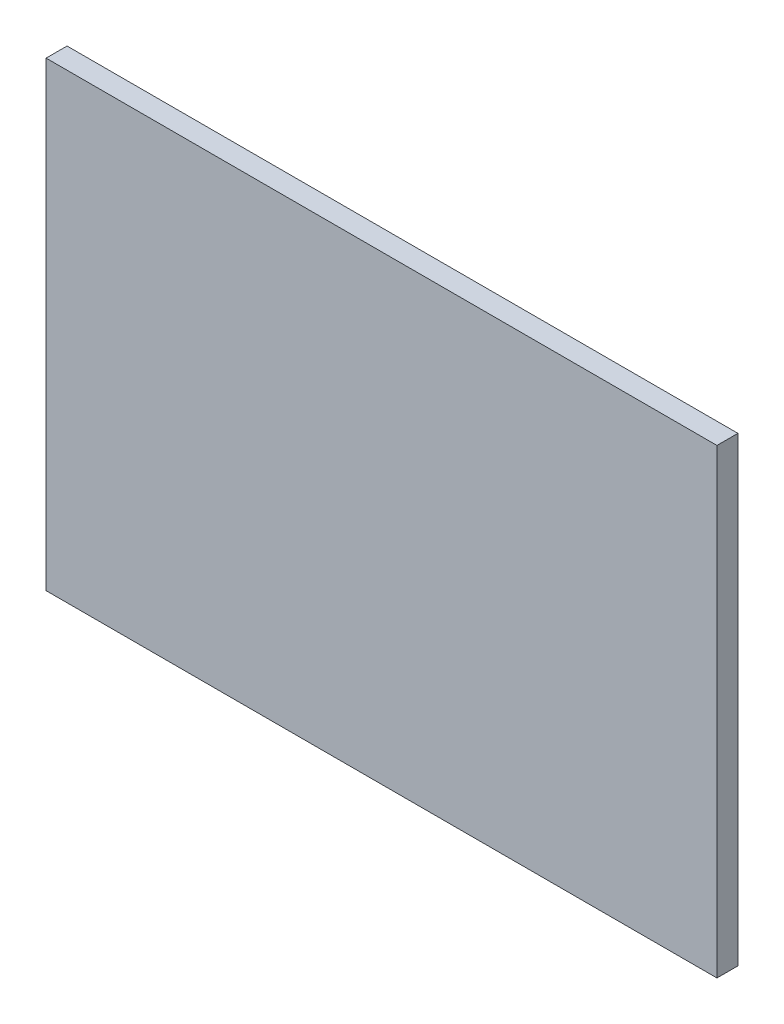
ISO-10303-21;
HEADER;
FILE_DESCRIPTION(('STEP AP214'),'2;1');
FILE_NAME('part.step','',(''),(''),'','','');
FILE_SCHEMA(('AUTOMOTIVE_DESIGN { 1 0 10303 214 1 1 1 1 }'));
ENDSEC;
DATA;
#1=APPLICATION_CONTEXT('core data for automotive mechanical design processes');
#2=APPLICATION_PROTOCOL_DEFINITION('international standard','automotive_design',2000,#1);
#3=PRODUCT_CONTEXT('',#1,'mechanical');
#4=PRODUCT('Part','Part','',(#3));
#5=PRODUCT_RELATED_PRODUCT_CATEGORY('part','',(#4));
#6=PRODUCT_DEFINITION_FORMATION('','',#4);
#7=PRODUCT_DEFINITION_CONTEXT('part definition',#1,'design');
#8=PRODUCT_DEFINITION('design','',#6,#7);
#9=PRODUCT_DEFINITION_SHAPE('','',#8);
#10=(LENGTH_UNIT() NAMED_UNIT(*) SI_UNIT(.MILLI.,.METRE.));
#11=(NAMED_UNIT(*) PLANE_ANGLE_UNIT() SI_UNIT($,.RADIAN.));
#12=(NAMED_UNIT(*) SI_UNIT($,.STERADIAN.) SOLID_ANGLE_UNIT());
#13=UNCERTAINTY_MEASURE_WITH_UNIT(LENGTH_MEASURE(1.E-05),#10,'distance_accuracy_value','');
#14=(GEOMETRIC_REPRESENTATION_CONTEXT(3) GLOBAL_UNCERTAINTY_ASSIGNED_CONTEXT((#13)) GLOBAL_UNIT_ASSIGNED_CONTEXT((#10,
#11,#12)) REPRESENTATION_CONTEXT('',''));
#15=CARTESIAN_POINT('',(0.,0.,0.));
#16=DIRECTION('',(0.,0.,1.));
#17=DIRECTION('',(1.,0.,0.));
#18=AXIS2_PLACEMENT_3D('',#15,#16,#17);
#19=CARTESIAN_POINT('',(0.,0.,25.));
#20=DIRECTION('',(1.,0.,0.));
#21=DIRECTION('',(0.,0.,-1.));
#22=AXIS2_PLACEMENT_3D('',#19,#20,#21);
#23=PLANE('',#22);
#24=DIRECTION('',(0.,-1.,0.));
#25=VECTOR('',#24,1.);
#26=CARTESIAN_POINT('',(0.,0.,0.));
#27=LINE('',#26,#25);
#28=CARTESIAN_POINT('',(0.,550.,0.));
#29=VERTEX_POINT('',#28);
#30=CARTESIAN_POINT('',(0.,0.,0.));
#31=VERTEX_POINT('',#30);
#32=EDGE_CURVE('E111',#29,#31,#27,.T.);
#33=ORIENTED_EDGE('',*,*,#32,.T.);
#34=DIRECTION('',(0.,0.,-1.));
#35=VECTOR('',#34,1.);
#36=CARTESIAN_POINT('',(0.,0.,25.));
#37=LINE('',#36,#35);
#38=CARTESIAN_POINT('',(0.,0.,25.));
#39=VERTEX_POINT('',#38);
#40=EDGE_CURVE('E11',#39,#31,#37,.T.);
#41=ORIENTED_EDGE('',*,*,#40,.F.);
#42=DIRECTION('',(0.,-1.,0.));
#43=VECTOR('',#42,1.);
#44=CARTESIAN_POINT('',(0.,0.,25.));
#45=LINE('',#44,#43);
#46=CARTESIAN_POINT('',(0.,550.,25.));
#47=VERTEX_POINT('',#46);
#48=EDGE_CURVE('E95',#47,#39,#45,.T.);
#49=ORIENTED_EDGE('',*,*,#48,.F.);
#50=DIRECTION('',(0.,0.,-1.));
#51=VECTOR('',#50,1.);
#52=CARTESIAN_POINT('',(0.,550.,25.));
#53=LINE('',#52,#51);
#54=EDGE_CURVE('E107',#47,#29,#53,.T.);
#55=ORIENTED_EDGE('',*,*,#54,.T.);
#56=EDGE_LOOP('',(#33,#41,#49,#55));
#57=FACE_BOUND('',#56,.T.);
#58=ADVANCED_FACE('F43',(#57),#23,.F.);
#59=CARTESIAN_POINT('',(0.,0.,25.));
#60=DIRECTION('',(0.,1.,0.));
#61=DIRECTION('',(0.,0.,1.));
#62=AXIS2_PLACEMENT_3D('',#59,#60,#61);
#63=PLANE('',#62);
#64=DIRECTION('',(1.,0.,0.));
#65=VECTOR('',#64,1.);
#66=CARTESIAN_POINT('',(0.,0.,0.));
#67=LINE('',#66,#65);
#68=CARTESIAN_POINT('',(800.,0.,0.));
#69=VERTEX_POINT('',#68);
#70=EDGE_CURVE('E100',#31,#69,#67,.T.);
#71=ORIENTED_EDGE('',*,*,#70,.T.);
#72=DIRECTION('',(0.,0.,-1.));
#73=VECTOR('',#72,1.);
#74=CARTESIAN_POINT('',(800.,0.,25.));
#75=LINE('',#74,#73);
#76=CARTESIAN_POINT('',(800.,0.,25.));
#77=VERTEX_POINT('',#76);
#78=EDGE_CURVE('E52',#77,#69,#75,.T.);
#79=ORIENTED_EDGE('',*,*,#78,.F.);
#80=DIRECTION('',(1.,0.,0.));
#81=VECTOR('',#80,1.);
#82=CARTESIAN_POINT('',(0.,0.,25.));
#83=LINE('',#82,#81);
#84=EDGE_CURVE('E90',#39,#77,#83,.T.);
#85=ORIENTED_EDGE('',*,*,#84,.F.);
#86=ORIENTED_EDGE('',*,*,#40,.T.);
#87=EDGE_LOOP('',(#71,#79,#85,#86));
#88=FACE_BOUND('',#87,.T.);
#89=ADVANCED_FACE('F99',(#88),#63,.F.);
#90=CARTESIAN_POINT('',(800.,0.,25.));
#91=DIRECTION('',(-1.,0.,0.));
#92=DIRECTION('',(0.,0.,1.));
#93=AXIS2_PLACEMENT_3D('',#90,#91,#92);
#94=PLANE('',#93);
#95=DIRECTION('',(0.,1.,0.));
#96=VECTOR('',#95,1.);
#97=CARTESIAN_POINT('',(800.,0.,0.));
#98=LINE('',#97,#96);
#99=CARTESIAN_POINT('',(800.,550.,0.));
#100=VERTEX_POINT('',#99);
#101=EDGE_CURVE('E77',#69,#100,#98,.T.);
#102=ORIENTED_EDGE('',*,*,#101,.T.);
#103=DIRECTION('',(0.,0.,-1.));
#104=VECTOR('',#103,1.);
#105=CARTESIAN_POINT('',(800.,550.,25.));
#106=LINE('',#105,#104);
#107=CARTESIAN_POINT('',(800.,550.,25.));
#108=VERTEX_POINT('',#107);
#109=EDGE_CURVE('E102',#108,#100,#106,.T.);
#110=ORIENTED_EDGE('',*,*,#109,.F.);
#111=DIRECTION('',(0.,1.,0.));
#112=VECTOR('',#111,1.);
#113=CARTESIAN_POINT('',(800.,0.,25.));
#114=LINE('',#113,#112);
#115=EDGE_CURVE('E93',#77,#108,#114,.T.);
#116=ORIENTED_EDGE('',*,*,#115,.F.);
#117=ORIENTED_EDGE('',*,*,#78,.T.);
#118=EDGE_LOOP('',(#102,#110,#116,#117));
#119=FACE_BOUND('',#118,.T.);
#120=ADVANCED_FACE('F103',(#119),#94,.F.);
#121=CARTESIAN_POINT('',(0.,550.,25.));
#122=DIRECTION('',(0.,-1.,0.));
#123=DIRECTION('',(0.,0.,-1.));
#124=AXIS2_PLACEMENT_3D('',#121,#122,#123);
#125=PLANE('',#124);
#126=DIRECTION('',(-1.,0.,0.));
#127=VECTOR('',#126,1.);
#128=CARTESIAN_POINT('',(0.,550.,0.));
#129=LINE('',#128,#127);
#130=EDGE_CURVE('E83',#100,#29,#129,.T.);
#131=ORIENTED_EDGE('',*,*,#130,.T.);
#132=ORIENTED_EDGE('',*,*,#54,.F.);
#133=DIRECTION('',(-1.,0.,0.));
#134=VECTOR('',#133,1.);
#135=CARTESIAN_POINT('',(0.,550.,25.));
#136=LINE('',#135,#134);
#137=EDGE_CURVE('E60',#108,#47,#136,.T.);
#138=ORIENTED_EDGE('',*,*,#137,.F.);
#139=ORIENTED_EDGE('',*,*,#109,.T.);
#140=EDGE_LOOP('',(#131,#132,#138,#139));
#141=FACE_BOUND('',#140,.T.);
#142=ADVANCED_FACE('F124',(#141),#125,.F.);
#143=CARTESIAN_POINT('',(0.,0.,25.));
#144=DIRECTION('',(0.,0.,-1.));
#145=DIRECTION('',(-1.,0.,0.));
#146=AXIS2_PLACEMENT_3D('',#143,#144,#145);
#147=PLANE('',#146);
#148=ORIENTED_EDGE('',*,*,#48,.T.);
#149=ORIENTED_EDGE('',*,*,#84,.T.);
#150=ORIENTED_EDGE('',*,*,#115,.T.);
#151=ORIENTED_EDGE('',*,*,#137,.T.);
#152=EDGE_LOOP('',(#148,#149,#150,#151));
#153=FACE_BOUND('',#152,.T.);
#154=ADVANCED_FACE('F91',(#153),#147,.F.);
#155=CARTESIAN_POINT('',(0.,0.,0.));
#156=DIRECTION('',(0.,0.,-1.));
#157=DIRECTION('',(-1.,0.,0.));
#158=AXIS2_PLACEMENT_3D('',#155,#156,#157);
#159=PLANE('',#158);
#160=ORIENTED_EDGE('',*,*,#32,.F.);
#161=ORIENTED_EDGE('',*,*,#130,.F.);
#162=ORIENTED_EDGE('',*,*,#101,.F.);
#163=ORIENTED_EDGE('',*,*,#70,.F.);
#164=EDGE_LOOP('',(#160,#161,#162,#163));
#165=FACE_BOUND('',#164,.T.);
#166=ADVANCED_FACE('F127',(#165),#159,.T.);
#167=CLOSED_SHELL('',(#58,#89,#120,#142,#154,#166));
#168=MANIFOLD_SOLID_BREP('B2',#167);
#169=ADVANCED_BREP_SHAPE_REPRESENTATION('',(#18,#168),#14);
#170=SHAPE_DEFINITION_REPRESENTATION(#9,#169);
ENDSEC;
END-ISO-10303-21;
